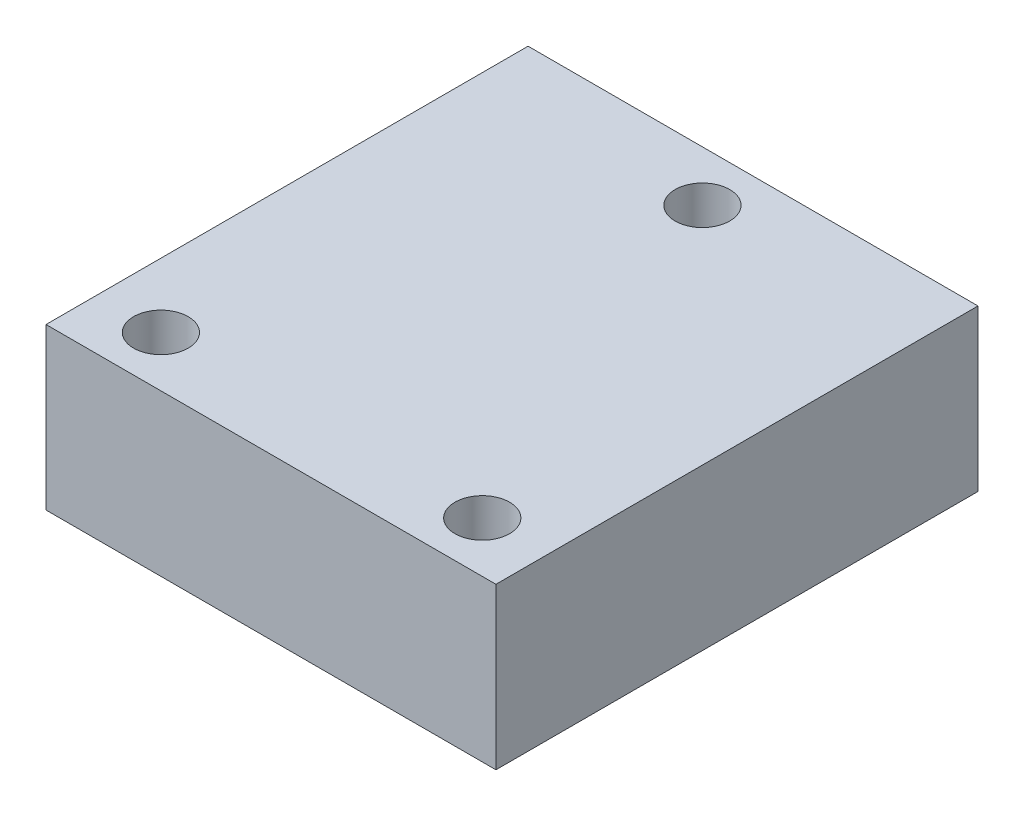
ISO-10303-21;
HEADER;
FILE_DESCRIPTION(('STEP AP214'),'2;1');
FILE_NAME('part.step','',(''),(''),'','','');
FILE_SCHEMA(('AUTOMOTIVE_DESIGN { 1 0 10303 214 1 1 1 1 }'));
ENDSEC;
DATA;
#1=APPLICATION_CONTEXT('core data for automotive mechanical design processes');
#2=APPLICATION_PROTOCOL_DEFINITION('international standard','automotive_design',2000,#1);
#3=PRODUCT_CONTEXT('',#1,'mechanical');
#4=PRODUCT('Part','Part','',(#3));
#5=PRODUCT_RELATED_PRODUCT_CATEGORY('part','',(#4));
#6=PRODUCT_DEFINITION_FORMATION('','',#4);
#7=PRODUCT_DEFINITION_CONTEXT('part definition',#1,'design');
#8=PRODUCT_DEFINITION('design','',#6,#7);
#9=PRODUCT_DEFINITION_SHAPE('','',#8);
#10=(LENGTH_UNIT() NAMED_UNIT(*) SI_UNIT(.MILLI.,.METRE.));
#11=(NAMED_UNIT(*) PLANE_ANGLE_UNIT() SI_UNIT($,.RADIAN.));
#12=(NAMED_UNIT(*) SI_UNIT($,.STERADIAN.) SOLID_ANGLE_UNIT());
#13=UNCERTAINTY_MEASURE_WITH_UNIT(LENGTH_MEASURE(1.E-05),#10,'distance_accuracy_value','');
#14=(GEOMETRIC_REPRESENTATION_CONTEXT(3) GLOBAL_UNCERTAINTY_ASSIGNED_CONTEXT((#13)) GLOBAL_UNIT_ASSIGNED_CONTEXT((#10,
#11,#12)) REPRESENTATION_CONTEXT('',''));
#15=CARTESIAN_POINT('',(0.,0.,0.));
#16=DIRECTION('',(0.,0.,1.));
#17=DIRECTION('',(1.,0.,0.));
#18=AXIS2_PLACEMENT_3D('',#15,#16,#17);
#19=CARTESIAN_POINT('',(14.,10.,-15.));
#20=DIRECTION('',(-1.,0.,0.));
#21=DIRECTION('',(0.,0.,1.));
#22=AXIS2_PLACEMENT_3D('',#19,#20,#21);
#23=PLANE('',#22);
#24=DIRECTION('',(0.,0.,-1.));
#25=VECTOR('',#24,1.);
#26=CARTESIAN_POINT('',(14.,0.,-15.));
#27=LINE('',#26,#25);
#28=CARTESIAN_POINT('',(14.,0.,15.));
#29=VERTEX_POINT('',#28);
#30=CARTESIAN_POINT('',(14.,0.,-15.));
#31=VERTEX_POINT('',#30);
#32=EDGE_CURVE('E98',#29,#31,#27,.T.);
#33=ORIENTED_EDGE('',*,*,#32,.T.);
#34=DIRECTION('',(0.,-1.,0.));
#35=VECTOR('',#34,1.);
#36=CARTESIAN_POINT('',(14.,10.,-15.));
#37=LINE('',#36,#35);
#38=CARTESIAN_POINT('',(14.,10.,-15.));
#39=VERTEX_POINT('',#38);
#40=EDGE_CURVE('E11',#39,#31,#37,.T.);
#41=ORIENTED_EDGE('',*,*,#40,.F.);
#42=DIRECTION('',(0.,0.,-1.));
#43=VECTOR('',#42,1.);
#44=CARTESIAN_POINT('',(14.,10.,-15.));
#45=LINE('',#44,#43);
#46=CARTESIAN_POINT('',(14.,10.,15.));
#47=VERTEX_POINT('',#46);
#48=EDGE_CURVE('E86',#47,#39,#45,.T.);
#49=ORIENTED_EDGE('',*,*,#48,.F.);
#50=DIRECTION('',(0.,-1.,0.));
#51=VECTOR('',#50,1.);
#52=CARTESIAN_POINT('',(14.,10.,15.));
#53=LINE('',#52,#51);
#54=EDGE_CURVE('E94',#47,#29,#53,.T.);
#55=ORIENTED_EDGE('',*,*,#54,.T.);
#56=EDGE_LOOP('',(#33,#41,#49,#55));
#57=FACE_BOUND('',#56,.T.);
#58=ADVANCED_FACE('F35',(#57),#23,.F.);
#59=CARTESIAN_POINT('',(-14.,10.,-15.));
#60=DIRECTION('',(0.,0.,1.));
#61=DIRECTION('',(1.,0.,0.));
#62=AXIS2_PLACEMENT_3D('',#59,#60,#61);
#63=PLANE('',#62);
#64=DIRECTION('',(-1.,0.,0.));
#65=VECTOR('',#64,1.);
#66=CARTESIAN_POINT('',(-14.,0.,-15.));
#67=LINE('',#66,#65);
#68=CARTESIAN_POINT('',(-14.,0.,-15.));
#69=VERTEX_POINT('',#68);
#70=EDGE_CURVE('E90',#31,#69,#67,.T.);
#71=ORIENTED_EDGE('',*,*,#70,.T.);
#72=DIRECTION('',(0.,-1.,0.));
#73=VECTOR('',#72,1.);
#74=CARTESIAN_POINT('',(-14.,10.,-15.));
#75=LINE('',#74,#73);
#76=CARTESIAN_POINT('',(-14.,10.,-15.));
#77=VERTEX_POINT('',#76);
#78=EDGE_CURVE('E43',#77,#69,#75,.T.);
#79=ORIENTED_EDGE('',*,*,#78,.F.);
#80=DIRECTION('',(-1.,0.,0.));
#81=VECTOR('',#80,1.);
#82=CARTESIAN_POINT('',(-14.,10.,-15.));
#83=LINE('',#82,#81);
#84=EDGE_CURVE('E81',#39,#77,#83,.T.);
#85=ORIENTED_EDGE('',*,*,#84,.F.);
#86=ORIENTED_EDGE('',*,*,#40,.T.);
#87=EDGE_LOOP('',(#71,#79,#85,#86));
#88=FACE_BOUND('',#87,.T.);
#89=ADVANCED_FACE('F89',(#88),#63,.F.);
#90=CARTESIAN_POINT('',(-14.,10.,-15.));
#91=DIRECTION('',(1.,0.,0.));
#92=DIRECTION('',(0.,0.,-1.));
#93=AXIS2_PLACEMENT_3D('',#90,#91,#92);
#94=PLANE('',#93);
#95=DIRECTION('',(0.,0.,1.));
#96=VECTOR('',#95,1.);
#97=CARTESIAN_POINT('',(-14.,0.,-15.));
#98=LINE('',#97,#96);
#99=CARTESIAN_POINT('',(-14.,0.,15.));
#100=VERTEX_POINT('',#99);
#101=EDGE_CURVE('E68',#69,#100,#98,.T.);
#102=ORIENTED_EDGE('',*,*,#101,.T.);
#103=DIRECTION('',(0.,-1.,0.));
#104=VECTOR('',#103,1.);
#105=CARTESIAN_POINT('',(-14.,10.,15.));
#106=LINE('',#105,#104);
#107=CARTESIAN_POINT('',(-14.,10.,15.));
#108=VERTEX_POINT('',#107);
#109=EDGE_CURVE('E91',#108,#100,#106,.T.);
#110=ORIENTED_EDGE('',*,*,#109,.F.);
#111=DIRECTION('',(0.,0.,1.));
#112=VECTOR('',#111,1.);
#113=CARTESIAN_POINT('',(-14.,10.,-15.));
#114=LINE('',#113,#112);
#115=EDGE_CURVE('E84',#77,#108,#114,.T.);
#116=ORIENTED_EDGE('',*,*,#115,.F.);
#117=ORIENTED_EDGE('',*,*,#78,.T.);
#118=EDGE_LOOP('',(#102,#110,#116,#117));
#119=FACE_BOUND('',#118,.T.);
#120=ADVANCED_FACE('F92',(#119),#94,.F.);
#121=CARTESIAN_POINT('',(-14.,10.,15.));
#122=DIRECTION('',(0.,0.,-1.));
#123=DIRECTION('',(-1.,0.,0.));
#124=AXIS2_PLACEMENT_3D('',#121,#122,#123);
#125=PLANE('',#124);
#126=DIRECTION('',(1.,0.,0.));
#127=VECTOR('',#126,1.);
#128=CARTESIAN_POINT('',(-14.,0.,15.));
#129=LINE('',#128,#127);
#130=EDGE_CURVE('E74',#100,#29,#129,.T.);
#131=ORIENTED_EDGE('',*,*,#130,.T.);
#132=ORIENTED_EDGE('',*,*,#54,.F.);
#133=DIRECTION('',(1.,0.,0.));
#134=VECTOR('',#133,1.);
#135=CARTESIAN_POINT('',(-14.,10.,15.));
#136=LINE('',#135,#134);
#137=EDGE_CURVE('E51',#108,#47,#136,.T.);
#138=ORIENTED_EDGE('',*,*,#137,.F.);
#139=ORIENTED_EDGE('',*,*,#109,.T.);
#140=EDGE_LOOP('',(#131,#132,#138,#139));
#141=FACE_BOUND('',#140,.T.);
#142=ADVANCED_FACE('F106',(#141),#125,.F.);
#143=CARTESIAN_POINT('',(0.,10.,0.));
#144=DIRECTION('',(0.,1.,0.));
#145=DIRECTION('',(0.,0.,1.));
#146=AXIS2_PLACEMENT_3D('',#143,#144,#145);
#147=PLANE('',#146);
#148=CARTESIAN_POINT('',(0.,10.,-11.85));
#149=DIRECTION('',(0.,1.,0.));
#150=DIRECTION('',(0.,0.,1.));
#151=AXIS2_PLACEMENT_3D('',#148,#149,#150);
#152=CIRCLE('',#151,1.7);
#153=CARTESIAN_POINT('',(0.,10.,-10.15));
#154=VERTEX_POINT('',#153);
#155=EDGE_CURVE('E124',#154,#154,#152,.T.);
#156=ORIENTED_EDGE('',*,*,#155,.F.);
#157=EDGE_LOOP('',(#156));
#158=FACE_BOUND('',#157,.T.);
#159=CARTESIAN_POINT('',(-10.,10.,11.85));
#160=DIRECTION('',(0.,1.,0.));
#161=DIRECTION('',(0.,0.,1.));
#162=AXIS2_PLACEMENT_3D('',#159,#160,#161);
#163=CIRCLE('',#162,1.7);
#164=CARTESIAN_POINT('',(-10.,10.,13.55));
#165=VERTEX_POINT('',#164);
#166=EDGE_CURVE('E118',#165,#165,#163,.T.);
#167=ORIENTED_EDGE('',*,*,#166,.F.);
#168=EDGE_LOOP('',(#167));
#169=FACE_BOUND('',#168,.T.);
#170=CARTESIAN_POINT('',(10.,10.,11.85));
#171=DIRECTION('',(0.,1.,0.));
#172=DIRECTION('',(0.,0.,1.));
#173=AXIS2_PLACEMENT_3D('',#170,#171,#172);
#174=CIRCLE('',#173,1.7);
#175=CARTESIAN_POINT('',(10.,10.,13.55));
#176=VERTEX_POINT('',#175);
#177=EDGE_CURVE('E112',#176,#176,#174,.T.);
#178=ORIENTED_EDGE('',*,*,#177,.F.);
#179=EDGE_LOOP('',(#178));
#180=FACE_BOUND('',#179,.T.);
#181=ORIENTED_EDGE('',*,*,#48,.T.);
#182=ORIENTED_EDGE('',*,*,#84,.T.);
#183=ORIENTED_EDGE('',*,*,#115,.T.);
#184=ORIENTED_EDGE('',*,*,#137,.T.);
#185=EDGE_LOOP('',(#181,#182,#183,#184));
#186=FACE_BOUND('',#185,.T.);
#187=ADVANCED_FACE('F82',(#158,#169,#180,#186),#147,.T.);
#188=CARTESIAN_POINT('',(0.,0.,0.));
#189=DIRECTION('',(0.,1.,0.));
#190=DIRECTION('',(0.,0.,1.));
#191=AXIS2_PLACEMENT_3D('',#188,#189,#190);
#192=PLANE('',#191);
#193=CARTESIAN_POINT('',(0.,0.,-11.85));
#194=DIRECTION('',(0.,1.,0.));
#195=DIRECTION('',(0.,0.,1.));
#196=AXIS2_PLACEMENT_3D('',#193,#194,#195);
#197=CIRCLE('',#196,1.7);
#198=CARTESIAN_POINT('',(0.,0.,-10.15));
#199=VERTEX_POINT('',#198);
#200=EDGE_CURVE('E101',#199,#199,#197,.T.);
#201=ORIENTED_EDGE('',*,*,#200,.T.);
#202=EDGE_LOOP('',(#201));
#203=FACE_BOUND('',#202,.T.);
#204=CARTESIAN_POINT('',(-10.,0.,11.85));
#205=DIRECTION('',(0.,1.,0.));
#206=DIRECTION('',(0.,0.,1.));
#207=AXIS2_PLACEMENT_3D('',#204,#205,#206);
#208=CIRCLE('',#207,1.7);
#209=CARTESIAN_POINT('',(-10.,0.,13.55));
#210=VERTEX_POINT('',#209);
#211=EDGE_CURVE('E121',#210,#210,#208,.T.);
#212=ORIENTED_EDGE('',*,*,#211,.T.);
#213=EDGE_LOOP('',(#212));
#214=FACE_BOUND('',#213,.T.);
#215=CARTESIAN_POINT('',(10.,0.,11.85));
#216=DIRECTION('',(0.,1.,0.));
#217=DIRECTION('',(0.,0.,1.));
#218=AXIS2_PLACEMENT_3D('',#215,#216,#217);
#219=CIRCLE('',#218,1.7);
#220=CARTESIAN_POINT('',(10.,0.,13.55));
#221=VERTEX_POINT('',#220);
#222=EDGE_CURVE('E115',#221,#221,#219,.T.);
#223=ORIENTED_EDGE('',*,*,#222,.T.);
#224=EDGE_LOOP('',(#223));
#225=FACE_BOUND('',#224,.T.);
#226=ORIENTED_EDGE('',*,*,#32,.F.);
#227=ORIENTED_EDGE('',*,*,#130,.F.);
#228=ORIENTED_EDGE('',*,*,#101,.F.);
#229=ORIENTED_EDGE('',*,*,#70,.F.);
#230=EDGE_LOOP('',(#226,#227,#228,#229));
#231=FACE_BOUND('',#230,.T.);
#232=ADVANCED_FACE('F109',(#203,#214,#225,#231),#192,.F.);
#233=CARTESIAN_POINT('',(10.,0.,11.85));
#234=DIRECTION('',(0.,1.,0.));
#235=DIRECTION('',(0.,0.,1.));
#236=AXIS2_PLACEMENT_3D('',#233,#234,#235);
#237=CYLINDRICAL_SURFACE('',#236,1.7);
#238=ORIENTED_EDGE('',*,*,#222,.F.);
#239=EDGE_LOOP('',(#238));
#240=FACE_BOUND('',#239,.T.);
#241=ORIENTED_EDGE('',*,*,#177,.T.);
#242=EDGE_LOOP('',(#241));
#243=FACE_BOUND('',#242,.T.);
#244=ADVANCED_FACE('F146',(#240,#243),#237,.F.);
#245=CARTESIAN_POINT('',(-10.,0.,11.85));
#246=DIRECTION('',(0.,1.,0.));
#247=DIRECTION('',(0.,0.,1.));
#248=AXIS2_PLACEMENT_3D('',#245,#246,#247);
#249=CYLINDRICAL_SURFACE('',#248,1.7);
#250=ORIENTED_EDGE('',*,*,#211,.F.);
#251=EDGE_LOOP('',(#250));
#252=FACE_BOUND('',#251,.T.);
#253=ORIENTED_EDGE('',*,*,#166,.T.);
#254=EDGE_LOOP('',(#253));
#255=FACE_BOUND('',#254,.T.);
#256=ADVANCED_FACE('F135',(#252,#255),#249,.F.);
#257=CARTESIAN_POINT('',(0.,0.,-11.85));
#258=DIRECTION('',(0.,1.,0.));
#259=DIRECTION('',(0.,0.,1.));
#260=AXIS2_PLACEMENT_3D('',#257,#258,#259);
#261=CYLINDRICAL_SURFACE('',#260,1.7);
#262=ORIENTED_EDGE('',*,*,#200,.F.);
#263=EDGE_LOOP('',(#262));
#264=FACE_BOUND('',#263,.T.);
#265=ORIENTED_EDGE('',*,*,#155,.T.);
#266=EDGE_LOOP('',(#265));
#267=FACE_BOUND('',#266,.T.);
#268=ADVANCED_FACE('F132',(#264,#267),#261,.F.);
#269=CLOSED_SHELL('',(#58,#89,#120,#142,#187,#232,#244,#256,#268));
#270=MANIFOLD_SOLID_BREP('B2',#269);
#271=ADVANCED_BREP_SHAPE_REPRESENTATION('',(#18,#270),#14);
#272=SHAPE_DEFINITION_REPRESENTATION(#9,#271);
ENDSEC;
END-ISO-10303-21;
